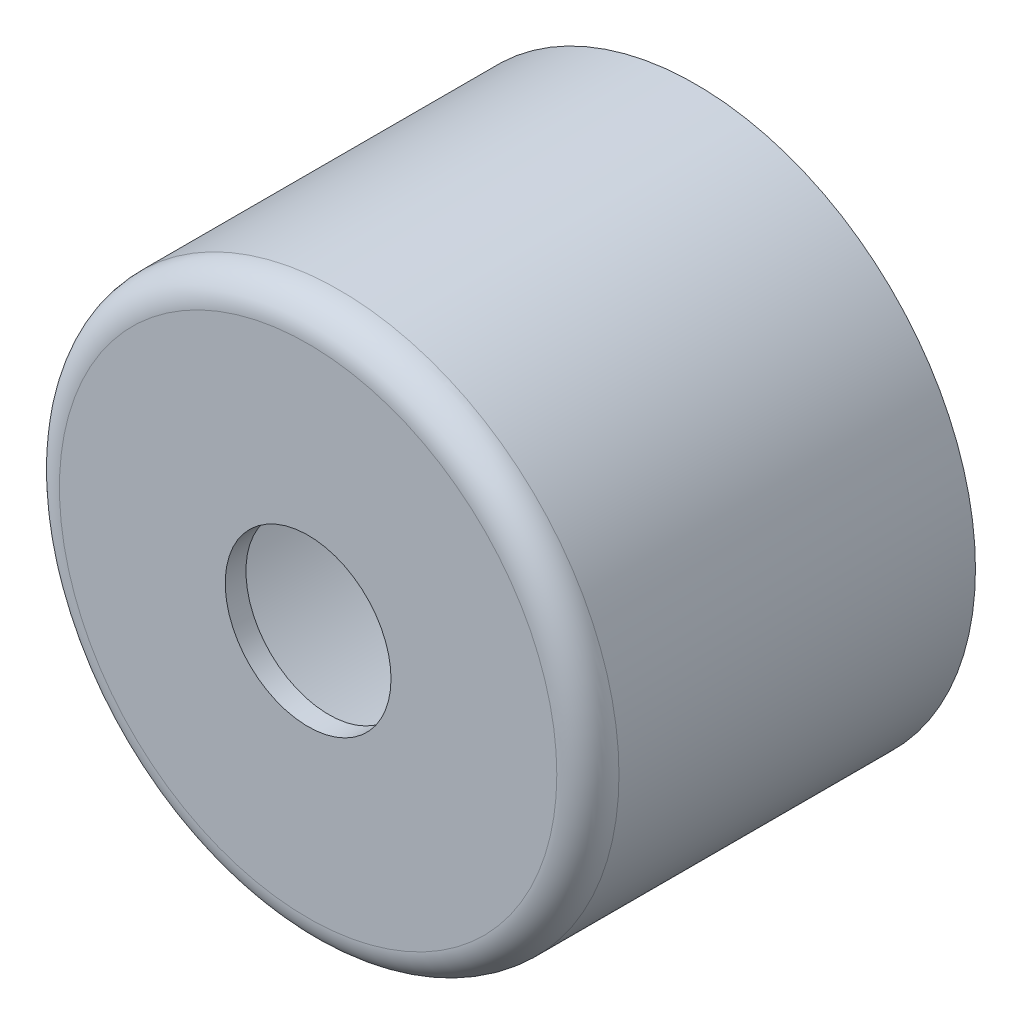
ISO-10303-21;
HEADER;
FILE_DESCRIPTION(('STEP AP214'),'2;1');
FILE_NAME('part.step','',(''),(''),'','','');
FILE_SCHEMA(('AUTOMOTIVE_DESIGN { 1 0 10303 214 1 1 1 1 }'));
ENDSEC;
DATA;
#1=APPLICATION_CONTEXT('core data for automotive mechanical design processes');
#2=APPLICATION_PROTOCOL_DEFINITION('international standard','automotive_design',2000,#1);
#3=PRODUCT_CONTEXT('',#1,'mechanical');
#4=PRODUCT('Part','Part','',(#3));
#5=PRODUCT_RELATED_PRODUCT_CATEGORY('part','',(#4));
#6=PRODUCT_DEFINITION_FORMATION('','',#4);
#7=PRODUCT_DEFINITION_CONTEXT('part definition',#1,'design');
#8=PRODUCT_DEFINITION('design','',#6,#7);
#9=PRODUCT_DEFINITION_SHAPE('','',#8);
#10=(LENGTH_UNIT() NAMED_UNIT(*) SI_UNIT(.MILLI.,.METRE.));
#11=(NAMED_UNIT(*) PLANE_ANGLE_UNIT() SI_UNIT($,.RADIAN.));
#12=(NAMED_UNIT(*) SI_UNIT($,.STERADIAN.) SOLID_ANGLE_UNIT());
#13=UNCERTAINTY_MEASURE_WITH_UNIT(LENGTH_MEASURE(1.E-05),#10,'distance_accuracy_value','');
#14=(GEOMETRIC_REPRESENTATION_CONTEXT(3) GLOBAL_UNCERTAINTY_ASSIGNED_CONTEXT((#13)) GLOBAL_UNIT_ASSIGNED_CONTEXT((#10,
#11,#12)) REPRESENTATION_CONTEXT('',''));
#15=CARTESIAN_POINT('',(0.,0.,0.));
#16=DIRECTION('',(0.,0.,1.));
#17=DIRECTION('',(1.,0.,0.));
#18=AXIS2_PLACEMENT_3D('',#15,#16,#17);
#19=CARTESIAN_POINT('',(0.,0.,18.7));
#20=DIRECTION('',(0.,0.,-1.));
#21=DIRECTION('',(-1.,0.,0.));
#22=AXIS2_PLACEMENT_3D('',#19,#20,#21);
#23=CYLINDRICAL_SURFACE('',#22,13.5);
#24=CARTESIAN_POINT('',(0.,0.,17.2));
#25=DIRECTION('',(0.,0.,1.));
#26=DIRECTION('',(1.,0.,0.));
#27=AXIS2_PLACEMENT_3D('',#24,#25,#26);
#28=CIRCLE('',#27,13.5);
#29=CARTESIAN_POINT('',(13.5,0.,17.2));
#30=VERTEX_POINT('',#29);
#31=EDGE_CURVE('E10',#30,#30,#28,.F.);
#32=ORIENTED_EDGE('',*,*,#31,.T.);
#33=EDGE_LOOP('',(#32));
#34=FACE_BOUND('',#33,.T.);
#35=CARTESIAN_POINT('',(0.,0.,0.));
#36=DIRECTION('',(0.,0.,1.));
#37=DIRECTION('',(1.,0.,0.));
#38=AXIS2_PLACEMENT_3D('',#35,#36,#37);
#39=CIRCLE('',#38,13.5);
#40=CARTESIAN_POINT('',(13.5,0.,0.));
#41=VERTEX_POINT('',#40);
#42=EDGE_CURVE('E42',#41,#41,#39,.T.);
#43=ORIENTED_EDGE('',*,*,#42,.T.);
#44=EDGE_LOOP('',(#43));
#45=FACE_BOUND('',#44,.T.);
#46=ADVANCED_FACE('F31',(#34,#45),#23,.T.);
#47=CARTESIAN_POINT('',(0.,0.,18.7));
#48=DIRECTION('',(0.,0.,1.));
#49=DIRECTION('',(1.,0.,0.));
#50=AXIS2_PLACEMENT_3D('',#47,#48,#49);
#51=PLANE('',#50);
#52=CARTESIAN_POINT('',(0.,0.,18.7));
#53=DIRECTION('',(0.,0.,1.));
#54=DIRECTION('',(1.,0.,0.));
#55=AXIS2_PLACEMENT_3D('',#52,#53,#54);
#56=CIRCLE('',#55,4.);
#57=CARTESIAN_POINT('',(4.,0.,18.7));
#58=VERTEX_POINT('',#57);
#59=EDGE_CURVE('E56',#58,#58,#56,.T.);
#60=ORIENTED_EDGE('',*,*,#59,.F.);
#61=EDGE_LOOP('',(#60));
#62=FACE_BOUND('',#61,.T.);
#63=CARTESIAN_POINT('',(0.,0.,18.7));
#64=DIRECTION('',(0.,0.,1.));
#65=DIRECTION('',(1.,0.,0.));
#66=AXIS2_PLACEMENT_3D('',#63,#64,#65);
#67=CIRCLE('',#66,12.);
#68=CARTESIAN_POINT('',(12.,0.,18.7));
#69=VERTEX_POINT('',#68);
#70=EDGE_CURVE('E38',#69,#69,#67,.T.);
#71=ORIENTED_EDGE('',*,*,#70,.T.);
#72=EDGE_LOOP('',(#71));
#73=FACE_BOUND('',#72,.T.);
#74=ADVANCED_FACE('F77',(#62,#73),#51,.T.);
#75=CARTESIAN_POINT('',(0.,0.,0.));
#76=DIRECTION('',(0.,0.,1.));
#77=DIRECTION('',(1.,0.,0.));
#78=AXIS2_PLACEMENT_3D('',#75,#76,#77);
#79=PLANE('',#78);
#80=CARTESIAN_POINT('',(0.,0.,0.));
#81=DIRECTION('',(0.,0.,1.));
#82=DIRECTION('',(1.,0.,0.));
#83=AXIS2_PLACEMENT_3D('',#80,#81,#82);
#84=CIRCLE('',#83,12.5);
#85=CARTESIAN_POINT('',(12.5,0.,0.));
#86=VERTEX_POINT('',#85);
#87=EDGE_CURVE('E48',#86,#86,#84,.T.);
#88=ORIENTED_EDGE('',*,*,#87,.T.);
#89=EDGE_LOOP('',(#88));
#90=FACE_BOUND('',#89,.T.);
#91=ORIENTED_EDGE('',*,*,#42,.F.);
#92=EDGE_LOOP('',(#91));
#93=FACE_BOUND('',#92,.T.);
#94=ADVANCED_FACE('F81',(#90,#93),#79,.F.);
#95=CARTESIAN_POINT('',(0.,0.,17.2));
#96=DIRECTION('',(0.,0.,1.));
#97=DIRECTION('',(1.,0.,0.));
#98=AXIS2_PLACEMENT_3D('',#95,#96,#97);
#99=TOROIDAL_SURFACE('',#98,12.,1.5);
#100=ORIENTED_EDGE('',*,*,#31,.F.);
#101=EDGE_LOOP('',(#100));
#102=FACE_BOUND('',#101,.T.);
#103=ORIENTED_EDGE('',*,*,#70,.F.);
#104=EDGE_LOOP('',(#103));
#105=FACE_BOUND('',#104,.T.);
#106=ADVANCED_FACE('F87',(#102,#105),#99,.T.);
#107=CARTESIAN_POINT('',(0.,0.,18.7));
#108=DIRECTION('',(0.,0.,-1.));
#109=DIRECTION('',(-1.,0.,0.));
#110=AXIS2_PLACEMENT_3D('',#107,#108,#109);
#111=CYLINDRICAL_SURFACE('',#110,12.5);
#112=CARTESIAN_POINT('',(0.,0.,17.2));
#113=DIRECTION('',(0.,0.,-1.));
#114=DIRECTION('',(-1.,0.,0.));
#115=AXIS2_PLACEMENT_3D('',#112,#113,#114);
#116=CIRCLE('',#115,12.5);
#117=CARTESIAN_POINT('',(-12.5,0.,17.2));
#118=VERTEX_POINT('',#117);
#119=EDGE_CURVE('E47',#118,#118,#116,.T.);
#120=ORIENTED_EDGE('',*,*,#119,.F.);
#121=EDGE_LOOP('',(#120));
#122=FACE_BOUND('',#121,.T.);
#123=ORIENTED_EDGE('',*,*,#87,.F.);
#124=EDGE_LOOP('',(#123));
#125=FACE_BOUND('',#124,.T.);
#126=ADVANCED_FACE('F93',(#122,#125),#111,.F.);
#127=CARTESIAN_POINT('',(0.,0.,17.7));
#128=DIRECTION('',(0.,0.,1.));
#129=DIRECTION('',(1.,0.,0.));
#130=AXIS2_PLACEMENT_3D('',#127,#128,#129);
#131=PLANE('',#130);
#132=CARTESIAN_POINT('',(0.,0.,17.7));
#133=DIRECTION('',(0.,0.,1.));
#134=DIRECTION('',(1.,0.,0.));
#135=AXIS2_PLACEMENT_3D('',#132,#133,#134);
#136=CIRCLE('',#135,4.);
#137=CARTESIAN_POINT('',(4.,0.,17.7));
#138=VERTEX_POINT('',#137);
#139=EDGE_CURVE('E34',#138,#138,#136,.T.);
#140=ORIENTED_EDGE('',*,*,#139,.T.);
#141=EDGE_LOOP('',(#140));
#142=FACE_BOUND('',#141,.T.);
#143=CARTESIAN_POINT('',(0.,0.,17.7));
#144=DIRECTION('',(0.,0.,1.));
#145=DIRECTION('',(1.,0.,0.));
#146=AXIS2_PLACEMENT_3D('',#143,#144,#145);
#147=CIRCLE('',#146,12.);
#148=CARTESIAN_POINT('',(12.,0.,17.7));
#149=VERTEX_POINT('',#148);
#150=EDGE_CURVE('E51',#149,#149,#147,.T.);
#151=ORIENTED_EDGE('',*,*,#150,.F.);
#152=EDGE_LOOP('',(#151));
#153=FACE_BOUND('',#152,.T.);
#154=ADVANCED_FACE('F63',(#142,#153),#131,.F.);
#155=CARTESIAN_POINT('',(0.,0.,17.2));
#156=DIRECTION('',(0.,0.,1.));
#157=DIRECTION('',(1.,0.,0.));
#158=AXIS2_PLACEMENT_3D('',#155,#156,#157);
#159=TOROIDAL_SURFACE('',#158,12.,0.5);
#160=ORIENTED_EDGE('',*,*,#119,.T.);
#161=EDGE_LOOP('',(#160));
#162=FACE_BOUND('',#161,.T.);
#163=ORIENTED_EDGE('',*,*,#150,.T.);
#164=EDGE_LOOP('',(#163));
#165=FACE_BOUND('',#164,.T.);
#166=ADVANCED_FACE('F68',(#162,#165),#159,.F.);
#167=CARTESIAN_POINT('',(0.,0.,0.));
#168=DIRECTION('',(0.,0.,1.));
#169=DIRECTION('',(1.,0.,0.));
#170=AXIS2_PLACEMENT_3D('',#167,#168,#169);
#171=CYLINDRICAL_SURFACE('',#170,4.);
#172=ORIENTED_EDGE('',*,*,#59,.T.);
#173=EDGE_LOOP('',(#172));
#174=FACE_BOUND('',#173,.T.);
#175=ORIENTED_EDGE('',*,*,#139,.F.);
#176=EDGE_LOOP('',(#175));
#177=FACE_BOUND('',#176,.T.);
#178=ADVANCED_FACE('F66',(#174,#177),#171,.F.);
#179=CLOSED_SHELL('',(#46,#74,#94,#106,#126,#154,#166,#178));
#180=MANIFOLD_SOLID_BREP('B2',#179);
#181=ADVANCED_BREP_SHAPE_REPRESENTATION('',(#18,#180),#14);
#182=SHAPE_DEFINITION_REPRESENTATION(#9,#181);
ENDSEC;
END-ISO-10303-21;
